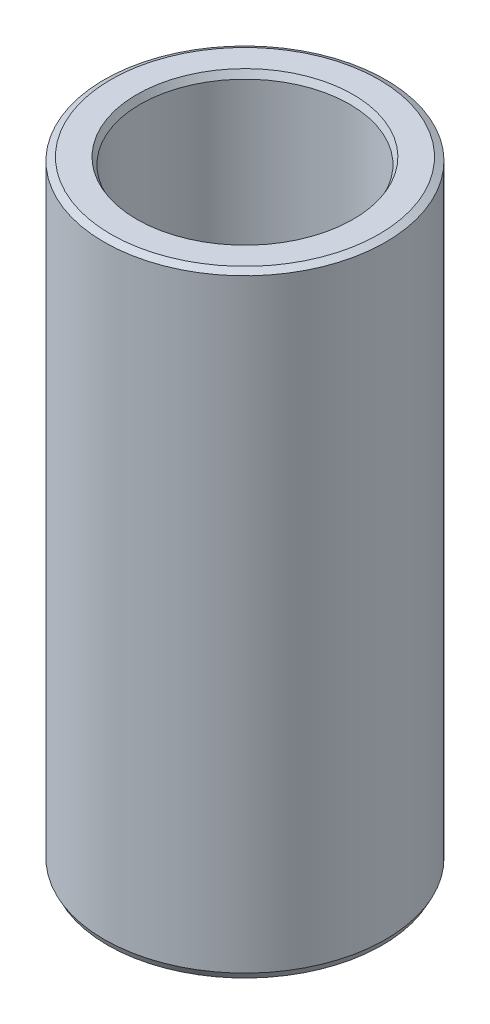
ISO-10303-21;
HEADER;
FILE_DESCRIPTION(('STEP AP214'),'2;1');
FILE_NAME('part.step','',(''),(''),'','','');
FILE_SCHEMA(('AUTOMOTIVE_DESIGN { 1 0 10303 214 1 1 1 1 }'));
ENDSEC;
DATA;
#1=APPLICATION_CONTEXT('core data for automotive mechanical design processes');
#2=APPLICATION_PROTOCOL_DEFINITION('international standard','automotive_design',2000,#1);
#3=PRODUCT_CONTEXT('',#1,'mechanical');
#4=PRODUCT('Part','Part','',(#3));
#5=PRODUCT_RELATED_PRODUCT_CATEGORY('part','',(#4));
#6=PRODUCT_DEFINITION_FORMATION('','',#4);
#7=PRODUCT_DEFINITION_CONTEXT('part definition',#1,'design');
#8=PRODUCT_DEFINITION('design','',#6,#7);
#9=PRODUCT_DEFINITION_SHAPE('','',#8);
#10=(LENGTH_UNIT() NAMED_UNIT(*) SI_UNIT(.MILLI.,.METRE.));
#11=(NAMED_UNIT(*) PLANE_ANGLE_UNIT() SI_UNIT($,.RADIAN.));
#12=(NAMED_UNIT(*) SI_UNIT($,.STERADIAN.) SOLID_ANGLE_UNIT());
#13=UNCERTAINTY_MEASURE_WITH_UNIT(LENGTH_MEASURE(1.E-05),#10,'distance_accuracy_value','');
#14=(GEOMETRIC_REPRESENTATION_CONTEXT(3) GLOBAL_UNCERTAINTY_ASSIGNED_CONTEXT((#13)) GLOBAL_UNIT_ASSIGNED_CONTEXT((#10,
#11,#12)) REPRESENTATION_CONTEXT('',''));
#15=CARTESIAN_POINT('',(0.,0.,0.));
#16=DIRECTION('',(0.,0.,1.));
#17=DIRECTION('',(1.,0.,0.));
#18=AXIS2_PLACEMENT_3D('',#15,#16,#17);
#19=CARTESIAN_POINT('',(0.,261.781373720959,0.));
#20=DIRECTION('',(0.,-1.,0.));
#21=DIRECTION('',(0.,0.,-1.));
#22=AXIS2_PLACEMENT_3D('',#19,#20,#21);
#23=CYLINDRICAL_SURFACE('',#22,60.);
#24=CARTESIAN_POINT('',(0.,2.85627603053151,0.));
#25=DIRECTION('',(0.,1.,0.));
#26=DIRECTION('',(0.,0.,1.));
#27=AXIS2_PLACEMENT_3D('',#24,#25,#26);
#28=CIRCLE('',#27,60.);
#29=CARTESIAN_POINT('',(0.,2.85627603053151,60.));
#30=VERTEX_POINT('',#29);
#31=EDGE_CURVE('E10',#30,#30,#28,.T.);
#32=ORIENTED_EDGE('',*,*,#31,.T.);
#33=EDGE_LOOP('',(#32));
#34=FACE_BOUND('',#33,.T.);
#35=CARTESIAN_POINT('',(0.,260.305961054207,0.));
#36=DIRECTION('',(0.,1.,0.));
#37=DIRECTION('',(0.,0.,1.));
#38=AXIS2_PLACEMENT_3D('',#35,#36,#37);
#39=CIRCLE('',#38,60.);
#40=CARTESIAN_POINT('',(0.,260.305961054207,60.));
#41=VERTEX_POINT('',#40);
#42=EDGE_CURVE('E50',#41,#41,#39,.F.);
#43=ORIENTED_EDGE('',*,*,#42,.T.);
#44=EDGE_LOOP('',(#43));
#45=FACE_BOUND('',#44,.T.);
#46=ADVANCED_FACE('F39',(#34,#45),#23,.T.);
#47=CARTESIAN_POINT('',(0.,261.781373720959,0.));
#48=DIRECTION('',(0.,1.,0.));
#49=DIRECTION('',(0.,0.,1.));
#50=AXIS2_PLACEMENT_3D('',#47,#48,#49);
#51=PLANE('',#50);
#52=CARTESIAN_POINT('',(0.,261.781373720959,0.));
#53=DIRECTION('',(0.,1.,0.));
#54=DIRECTION('',(0.,0.,1.));
#55=AXIS2_PLACEMENT_3D('',#52,#53,#54);
#56=CIRCLE('',#55,46.1091476419261);
#57=CARTESIAN_POINT('',(0.,261.781373720959,46.1091476419261));
#58=VERTEX_POINT('',#57);
#59=EDGE_CURVE('E58',#58,#58,#56,.F.);
#60=ORIENTED_EDGE('',*,*,#59,.T.);
#61=EDGE_LOOP('',(#60));
#62=FACE_BOUND('',#61,.T.);
#63=CARTESIAN_POINT('',(0.,261.781373720959,0.));
#64=DIRECTION('',(0.,1.,0.));
#65=DIRECTION('',(0.,0.,1.));
#66=AXIS2_PLACEMENT_3D('',#63,#64,#65);
#67=CIRCLE('',#66,57.1437239694684);
#68=CARTESIAN_POINT('',(0.,261.781373720959,57.1437239694684));
#69=VERTEX_POINT('',#68);
#70=EDGE_CURVE('E61',#69,#69,#67,.T.);
#71=ORIENTED_EDGE('',*,*,#70,.T.);
#72=EDGE_LOOP('',(#71));
#73=FACE_BOUND('',#72,.T.);
#74=ADVANCED_FACE('F88',(#62,#73),#51,.T.);
#75=CARTESIAN_POINT('',(0.,0.,0.));
#76=DIRECTION('',(0.,1.,0.));
#77=DIRECTION('',(0.,0.,1.));
#78=AXIS2_PLACEMENT_3D('',#75,#76,#77);
#79=PLANE('',#78);
#80=CARTESIAN_POINT('',(0.,0.,0.));
#81=DIRECTION('',(0.,1.,0.));
#82=DIRECTION('',(0.,0.,1.));
#83=AXIS2_PLACEMENT_3D('',#80,#81,#82);
#84=CIRCLE('',#83,47.490011005706);
#85=CARTESIAN_POINT('',(0.,0.,47.490011005706));
#86=VERTEX_POINT('',#85);
#87=EDGE_CURVE('E51',#86,#86,#84,.T.);
#88=ORIENTED_EDGE('',*,*,#87,.T.);
#89=EDGE_LOOP('',(#88));
#90=FACE_BOUND('',#89,.T.);
#91=CARTESIAN_POINT('',(0.,0.,0.));
#92=DIRECTION('',(0.,1.,0.));
#93=DIRECTION('',(0.,0.,1.));
#94=AXIS2_PLACEMENT_3D('',#91,#92,#93);
#95=CIRCLE('',#94,58.5245873332485);
#96=CARTESIAN_POINT('',(0.,0.,58.5245873332485));
#97=VERTEX_POINT('',#96);
#98=EDGE_CURVE('E54',#97,#97,#95,.F.);
#99=ORIENTED_EDGE('',*,*,#98,.T.);
#100=EDGE_LOOP('',(#99));
#101=FACE_BOUND('',#100,.T.);
#102=ADVANCED_FACE('F83',(#90,#101),#79,.F.);
#103=CARTESIAN_POINT('',(0.,261.781373720959,0.));
#104=DIRECTION('',(0.,-1.,0.));
#105=DIRECTION('',(0.,0.,-1.));
#106=AXIS2_PLACEMENT_3D('',#103,#104,#105);
#107=CYLINDRICAL_SURFACE('',#106,44.6337349751744);
#108=CARTESIAN_POINT('',(0.,258.925097690427,0.));
#109=DIRECTION('',(0.,1.,0.));
#110=DIRECTION('',(0.,0.,1.));
#111=AXIS2_PLACEMENT_3D('',#108,#109,#110);
#112=CIRCLE('',#111,44.6337349751744);
#113=CARTESIAN_POINT('',(0.,258.925097690427,44.6337349751744));
#114=VERTEX_POINT('',#113);
#115=EDGE_CURVE('E67',#114,#114,#112,.T.);
#116=ORIENTED_EDGE('',*,*,#115,.T.);
#117=EDGE_LOOP('',(#116));
#118=FACE_BOUND('',#117,.T.);
#119=CARTESIAN_POINT('',(0.,1.47541266675161,0.));
#120=DIRECTION('',(0.,1.,0.));
#121=DIRECTION('',(0.,0.,1.));
#122=AXIS2_PLACEMENT_3D('',#119,#120,#121);
#123=CIRCLE('',#122,44.6337349751744);
#124=CARTESIAN_POINT('',(0.,1.47541266675161,44.6337349751744));
#125=VERTEX_POINT('',#124);
#126=EDGE_CURVE('E69',#125,#125,#123,.F.);
#127=ORIENTED_EDGE('',*,*,#126,.T.);
#128=EDGE_LOOP('',(#127));
#129=FACE_BOUND('',#128,.T.);
#130=ADVANCED_FACE('F71',(#118,#129),#107,.F.);
#131=CARTESIAN_POINT('',(0.,258.925097690427,0.));
#132=DIRECTION('',(0.,1.,0.));
#133=DIRECTION('',(0.,0.,1.));
#134=AXIS2_PLACEMENT_3D('',#131,#132,#133);
#135=CONICAL_SURFACE('',#134,44.6337349751744,0.476800685572222);
#136=CARTESIAN_POINT('',(0.,261.781373720959,46.1091476419261));
#137=CARTESIAN_POINT('',(0.,261.751620845641,46.0937787599808));
#138=CARTESIAN_POINT('',(0.,261.721867970323,46.0784098780354));
#139=CARTESIAN_POINT('',(0.,261.662362219687,46.0476721141448));
#140=CARTESIAN_POINT('',(0.,261.632609344369,46.0323032321995));
#141=CARTESIAN_POINT('',(0.,261.573103593732,46.0015654683088));
#142=CARTESIAN_POINT('',(0.,261.543350718414,45.9861965863634));
#143=CARTESIAN_POINT('',(0.,261.483844967778,45.9554588224728));
#144=CARTESIAN_POINT('',(0.,261.45409209246,45.9400899405275));
#145=CARTESIAN_POINT('',(0.,261.394586341824,45.9093521766368));
#146=CARTESIAN_POINT('',(0.,261.364833466506,45.8939832946915));
#147=CARTESIAN_POINT('',(0.,261.30532771587,45.8632455308008));
#148=CARTESIAN_POINT('',(0.,261.275574840552,45.8478766488555));
#149=CARTESIAN_POINT('',(0.,261.216069089916,45.8171388849648));
#150=CARTESIAN_POINT('',(0.,261.186316214598,45.8017700030195));
#151=CARTESIAN_POINT('',(0.,261.126810463962,45.7710322391288));
#152=CARTESIAN_POINT('',(0.,261.097057588644,45.7556633571835));
#153=CARTESIAN_POINT('',(0.,261.037551838008,45.7249255932928));
#154=CARTESIAN_POINT('',(0.,261.00779896269,45.7095567113475));
#155=CARTESIAN_POINT('',(0.,260.948293212054,45.6788189474569));
#156=CARTESIAN_POINT('',(0.,260.918540336736,45.6634500655115));
#157=CARTESIAN_POINT('',(0.,260.859034586099,45.6327123016209));
#158=CARTESIAN_POINT('',(0.,260.829281710781,45.6173434196755));
#159=CARTESIAN_POINT('',(0.,260.769775960145,45.5866056557849));
#160=CARTESIAN_POINT('',(0.,260.740023084827,45.5712367738395));
#161=CARTESIAN_POINT('',(0.,260.680517334191,45.5404990099489));
#162=CARTESIAN_POINT('',(0.,260.650764458873,45.5251301280036));
#163=CARTESIAN_POINT('',(0.,260.591258708237,45.4943923641129));
#164=CARTESIAN_POINT('',(0.,260.561505832919,45.4790234821676));
#165=CARTESIAN_POINT('',(0.,260.502000082283,45.4482857182769));
#166=CARTESIAN_POINT('',(0.,260.472247206965,45.4329168363316));
#167=CARTESIAN_POINT('',(0.,260.412741456329,45.4021790724409));
#168=CARTESIAN_POINT('',(0.,260.382988581011,45.3868101904956));
#169=CARTESIAN_POINT('',(0.,260.323482830375,45.3560724266049));
#170=CARTESIAN_POINT('',(0.,260.293729955057,45.3407035446596));
#171=CARTESIAN_POINT('',(0.,260.234224204421,45.3099657807689));
#172=CARTESIAN_POINT('',(0.,260.204471329103,45.2945968988236));
#173=CARTESIAN_POINT('',(0.,260.144965578467,45.263859134933));
#174=CARTESIAN_POINT('',(0.,260.115212703149,45.2484902529876));
#175=CARTESIAN_POINT('',(0.,260.055706952512,45.217752489097));
#176=CARTESIAN_POINT('',(0.,260.025954077194,45.2023836071516));
#177=CARTESIAN_POINT('',(0.,259.966448326558,45.171645843261));
#178=CARTESIAN_POINT('',(0.,259.93669545124,45.1562769613156));
#179=CARTESIAN_POINT('',(0.,259.877189700604,45.125539197425));
#180=CARTESIAN_POINT('',(0.,259.847436825286,45.1101703154796));
#181=CARTESIAN_POINT('',(0.,259.78793107465,45.079432551589));
#182=CARTESIAN_POINT('',(0.,259.758178199332,45.0640636696437));
#183=CARTESIAN_POINT('',(0.,259.698672448696,45.033325905753));
#184=CARTESIAN_POINT('',(0.,259.668919573378,45.0179570238077));
#185=CARTESIAN_POINT('',(0.,259.609413822742,44.987219259917));
#186=CARTESIAN_POINT('',(0.,259.579660947424,44.9718503779717));
#187=CARTESIAN_POINT('',(0.,259.520155196788,44.941112614081));
#188=CARTESIAN_POINT('',(0.,259.49040232147,44.9257437321357));
#189=CARTESIAN_POINT('',(0.,259.430896570834,44.895005968245));
#190=CARTESIAN_POINT('',(0.,259.401143695516,44.8796370862997));
#191=CARTESIAN_POINT('',(0.,259.341637944879,44.848899322409));
#192=CARTESIAN_POINT('',(0.,259.311885069561,44.8335304404637));
#193=CARTESIAN_POINT('',(0.,259.252379318925,44.802792676573));
#194=CARTESIAN_POINT('',(0.,259.222626443607,44.7874237946277));
#195=CARTESIAN_POINT('',(0.,259.163120692971,44.7566860307371));
#196=CARTESIAN_POINT('',(0.,259.133367817653,44.7413171487917));
#197=CARTESIAN_POINT('',(0.,259.073862067017,44.7105793849011));
#198=CARTESIAN_POINT('',(0.,259.044109191699,44.6952105029557));
#199=CARTESIAN_POINT('',(0.,258.984603441063,44.6644727390651));
#200=CARTESIAN_POINT('',(0.,258.954850565745,44.6491038571198));
#201=CARTESIAN_POINT('',(0.,258.925097690427,44.6337349751744));
#202=B_SPLINE_CURVE_WITH_KNOTS('',3,(#136,#137,#138,#139,#140,#141,#142,#143,#144,#145,#146,
#147,#148,#149,#150,#151,#152,#153,#154,#155,#156,#157,#158,#159,#160,#161,#162,#163,#164,#165,
#166,#167,#168,#169,#170,#171,#172,#173,#174,#175,#176,#177,#178,#179,#180,#181,#182,#183,#184,
#185,#186,#187,#188,#189,#190,#191,#192,#193,#194,#195,#196,#197,#198,#199,#200,#201),
.UNSPECIFIED.,.F.,.F.,(4,2,2,2,2,2,2,2,2,2,2,2,2,2,2,2,2,2,2,2,2,2,2,2,2,2,2,2,2,2,2,2,4),(0.,
0.100463551089239,0.200927102178475,0.301390653267714,0.401854204356999,0.502317755446238,
0.602781306535473,0.703244857624762,0.803708408714001,0.904171959803237,1.00463551089252,
1.10509906198176,1.205562613071,1.30602616416028,1.40648971524952,1.50695326633876,
1.60741681742805,1.70788036851729,1.80834391960652,1.90880747069576,2.00927102178505,
2.10973457287429,2.21019812396352,2.31066167505281,2.41112522614205,2.51158877723128,
2.61205232832057,2.71251587940981,2.81297943049905,2.91344298158833,3.01390653267757,
3.11437008376681,3.21483363485604),.UNSPECIFIED.);
#203=EDGE_CURVE('BSEAM77',#58,#114,#202,.T.);
#204=ORIENTED_EDGE('',*,*,#59,.F.);
#205=ORIENTED_EDGE('',*,*,#115,.F.);
#206=ORIENTED_EDGE('',*,*,#203,.T.);
#207=ORIENTED_EDGE('',*,*,#203,.F.);
#208=EDGE_LOOP('',(#204,#206,#205,#207));
#209=FACE_BOUND('',#208,.T.);
#210=ADVANCED_FACE('F77',(#209),#135,.F.);
#211=CARTESIAN_POINT('',(0.,0.,0.));
#212=DIRECTION('',(0.,-1.,0.));
#213=DIRECTION('',(0.,0.,-1.));
#214=AXIS2_PLACEMENT_3D('',#211,#212,#213);
#215=CONICAL_SURFACE('',#214,47.490011005706,1.09399564122266);
#216=ORIENTED_EDGE('',*,*,#126,.F.);
#217=EDGE_LOOP('',(#216));
#218=FACE_BOUND('',#217,.T.);
#219=ORIENTED_EDGE('',*,*,#87,.F.);
#220=EDGE_LOOP('',(#219));
#221=FACE_BOUND('',#220,.T.);
#222=ADVANCED_FACE('F73',(#218,#221),#215,.F.);
#223=CARTESIAN_POINT('',(0.,2.85627603053151,0.));
#224=DIRECTION('',(0.,1.,0.));
#225=DIRECTION('',(0.,0.,1.));
#226=AXIS2_PLACEMENT_3D('',#223,#224,#225);
#227=CONICAL_SURFACE('',#226,60.,0.476800685572226);
#228=ORIENTED_EDGE('',*,*,#98,.F.);
#229=EDGE_LOOP('',(#228));
#230=FACE_BOUND('',#229,.T.);
#231=ORIENTED_EDGE('',*,*,#31,.F.);
#232=EDGE_LOOP('',(#231));
#233=FACE_BOUND('',#232,.T.);
#234=ADVANCED_FACE('F76',(#230,#233),#227,.T.);
#235=CARTESIAN_POINT('',(0.,261.781373720959,0.));
#236=DIRECTION('',(0.,-1.,0.));
#237=DIRECTION('',(0.,0.,-1.));
#238=AXIS2_PLACEMENT_3D('',#235,#236,#237);
#239=CONICAL_SURFACE('',#238,57.1437239694684,1.09399564122267);
#240=ORIENTED_EDGE('',*,*,#42,.F.);
#241=EDGE_LOOP('',(#240));
#242=FACE_BOUND('',#241,.T.);
#243=ORIENTED_EDGE('',*,*,#70,.F.);
#244=EDGE_LOOP('',(#243));
#245=FACE_BOUND('',#244,.T.);
#246=ADVANCED_FACE('F45',(#242,#245),#239,.T.);
#247=CLOSED_SHELL('',(#46,#74,#102,#130,#210,#222,#234,#246));
#248=MANIFOLD_SOLID_BREP('B2',#247);
#249=ADVANCED_BREP_SHAPE_REPRESENTATION('',(#18,#248),#14);
#250=SHAPE_DEFINITION_REPRESENTATION(#9,#249);
ENDSEC;
END-ISO-10303-21;
